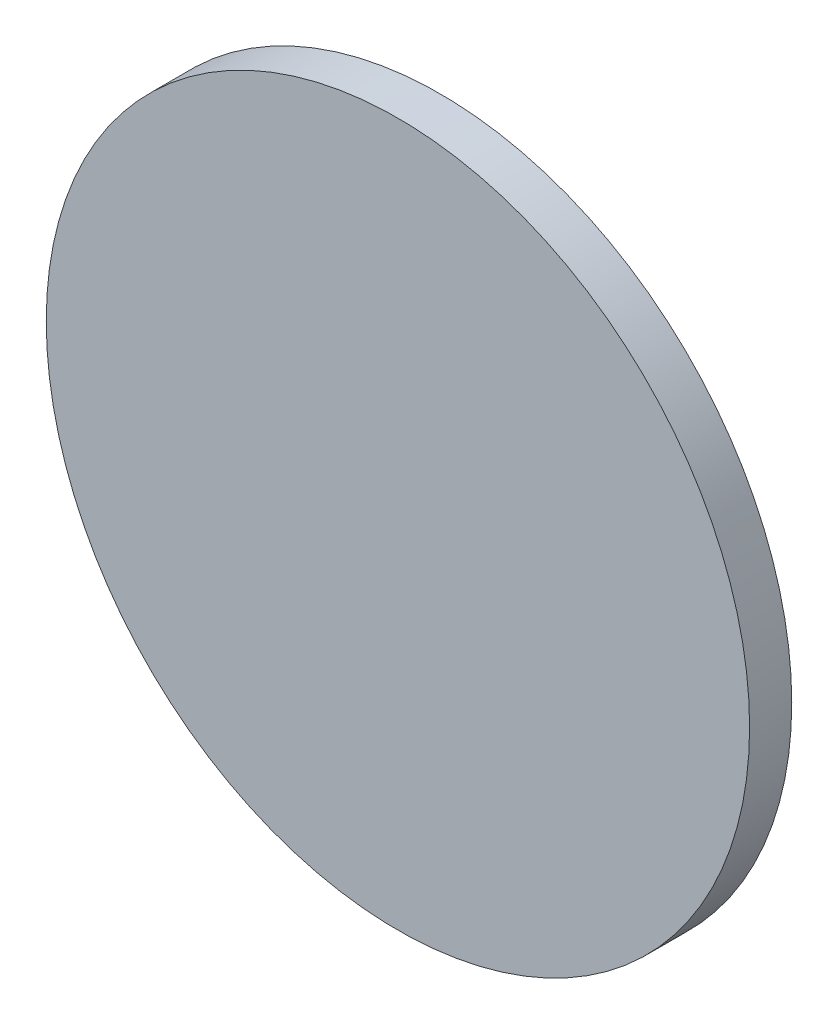
ISO-10303-21;
HEADER;
FILE_DESCRIPTION(('STEP AP214'),'2;1');
FILE_NAME('part.step','',(''),(''),'','','');
FILE_SCHEMA(('AUTOMOTIVE_DESIGN { 1 0 10303 214 1 1 1 1 }'));
ENDSEC;
DATA;
#1=APPLICATION_CONTEXT('core data for automotive mechanical design processes');
#2=APPLICATION_PROTOCOL_DEFINITION('international standard','automotive_design',2000,#1);
#3=PRODUCT_CONTEXT('',#1,'mechanical');
#4=PRODUCT('Part','Part','',(#3));
#5=PRODUCT_RELATED_PRODUCT_CATEGORY('part','',(#4));
#6=PRODUCT_DEFINITION_FORMATION('','',#4);
#7=PRODUCT_DEFINITION_CONTEXT('part definition',#1,'design');
#8=PRODUCT_DEFINITION('design','',#6,#7);
#9=PRODUCT_DEFINITION_SHAPE('','',#8);
#10=(LENGTH_UNIT() NAMED_UNIT(*) SI_UNIT(.MILLI.,.METRE.));
#11=(NAMED_UNIT(*) PLANE_ANGLE_UNIT() SI_UNIT($,.RADIAN.));
#12=(NAMED_UNIT(*) SI_UNIT($,.STERADIAN.) SOLID_ANGLE_UNIT());
#13=UNCERTAINTY_MEASURE_WITH_UNIT(LENGTH_MEASURE(1.E-05),#10,'distance_accuracy_value','');
#14=(GEOMETRIC_REPRESENTATION_CONTEXT(3) GLOBAL_UNCERTAINTY_ASSIGNED_CONTEXT((#13)) GLOBAL_UNIT_ASSIGNED_CONTEXT((#10,
#11,#12)) REPRESENTATION_CONTEXT('',''));
#15=CARTESIAN_POINT('',(0.,0.,0.));
#16=DIRECTION('',(0.,0.,1.));
#17=DIRECTION('',(1.,0.,0.));
#18=AXIS2_PLACEMENT_3D('',#15,#16,#17);
#19=CARTESIAN_POINT('',(0.,52.5864403883937,0.));
#20=DIRECTION('',(0.,0.,-1.));
#21=DIRECTION('',(-1.,0.,0.));
#22=AXIS2_PLACEMENT_3D('',#19,#20,#21);
#23=PLANE('',#22);
#24=CARTESIAN_POINT('',(0.,52.5864403883937,0.));
#25=DIRECTION('',(0.,0.,-1.));
#26=DIRECTION('',(-1.,0.,0.));
#27=AXIS2_PLACEMENT_3D('',#24,#25,#26);
#28=CIRCLE('',#27,116.218434465674);
#29=CARTESIAN_POINT('',(-116.218434465674,52.5864403883937,0.));
#30=VERTEX_POINT('',#29);
#31=EDGE_CURVE('E11',#30,#30,#28,.T.);
#32=ORIENTED_EDGE('',*,*,#31,.F.);
#33=EDGE_LOOP('',(#32));
#34=FACE_BOUND('',#33,.T.);
#35=ADVANCED_FACE('F33',(#34),#23,.F.);
#36=CARTESIAN_POINT('',(0.,52.5864403883937,-35.0576269255958));
#37=DIRECTION('',(0.,0.,-1.));
#38=DIRECTION('',(-1.,0.,0.));
#39=AXIS2_PLACEMENT_3D('',#36,#37,#38);
#40=CYLINDRICAL_SURFACE('',#39,116.218434465674);
#41=CARTESIAN_POINT('',(0.,52.5864403883937,-13.9270024772915));
#42=DIRECTION('',(0.,0.,-1.));
#43=DIRECTION('',(-1.,0.,0.));
#44=AXIS2_PLACEMENT_3D('',#41,#42,#43);
#45=CIRCLE('',#44,116.218434465674);
#46=CARTESIAN_POINT('',(-116.218434465674,52.5864403883937,-13.9270024772915));
#47=VERTEX_POINT('',#46);
#48=EDGE_CURVE('E39',#47,#47,#45,.T.);
#49=ORIENTED_EDGE('',*,*,#48,.F.);
#50=EDGE_LOOP('',(#49));
#51=FACE_BOUND('',#50,.T.);
#52=ORIENTED_EDGE('',*,*,#31,.T.);
#53=EDGE_LOOP('',(#52));
#54=FACE_BOUND('',#53,.T.);
#55=ADVANCED_FACE('F56',(#51,#54),#40,.T.);
#56=CARTESIAN_POINT('',(8.11548990332928E-13,168.804874854068,-13.9270024772915));
#57=DIRECTION('',(0.,0.,1.));
#58=DIRECTION('',(1.,0.,0.));
#59=AXIS2_PLACEMENT_3D('',#56,#57,#58);
#60=PLANE('',#59);
#61=CARTESIAN_POINT('',(0.,52.5864403883937,-13.9270024772915));
#62=DIRECTION('',(0.,0.,-1.));
#63=DIRECTION('',(-1.,0.,0.));
#64=AXIS2_PLACEMENT_3D('',#61,#62,#63);
#65=CIRCLE('',#64,52.5864403883937);
#66=CARTESIAN_POINT('',(-52.5864403883937,52.5864403883937,-13.9270024772915));
#67=VERTEX_POINT('',#66);
#68=EDGE_CURVE('E49',#67,#67,#65,.T.);
#69=ORIENTED_EDGE('',*,*,#68,.F.);
#70=EDGE_LOOP('',(#69));
#71=FACE_BOUND('',#70,.T.);
#72=ORIENTED_EDGE('',*,*,#48,.T.);
#73=EDGE_LOOP('',(#72));
#74=FACE_BOUND('',#73,.T.);
#75=ADVANCED_FACE('F45',(#71,#74),#60,.F.);
#76=CARTESIAN_POINT('',(0.,52.5864403883937,-13.9270024772915));
#77=DIRECTION('',(0.,0.,1.));
#78=DIRECTION('',(1.,0.,0.));
#79=AXIS2_PLACEMENT_3D('',#76,#77,#78);
#80=CONICAL_SURFACE('',#79,52.5864403883937,1.18871638685856);
#81=CARTESIAN_POINT('',(0.,52.5864403883937,-35.0576269255958));
#82=VERTEX_POINT('',#81);
#83=VERTEX_LOOP('',#82);
#84=FACE_BOUND('',#83,.T.);
#85=ORIENTED_EDGE('',*,*,#68,.T.);
#86=EDGE_LOOP('',(#85));
#87=FACE_BOUND('',#86,.T.);
#88=ADVANCED_FACE('F42',(#84,#87),#80,.T.);
#89=CLOSED_SHELL('',(#35,#55,#75,#88));
#90=MANIFOLD_SOLID_BREP('B2',#89);
#91=ADVANCED_BREP_SHAPE_REPRESENTATION('',(#18,#90),#14);
#92=SHAPE_DEFINITION_REPRESENTATION(#9,#91);
ENDSEC;
END-ISO-10303-21;
